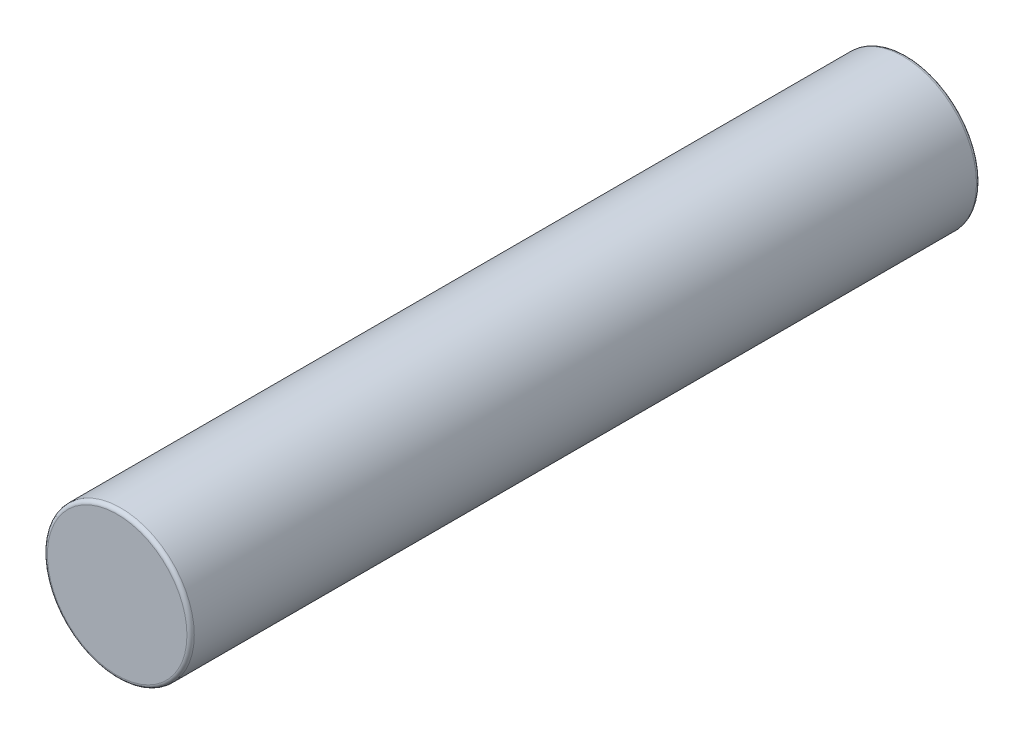
ISO-10303-21;
HEADER;
FILE_DESCRIPTION(('STEP AP214'),'2;1');
FILE_NAME('part.step','',(''),(''),'','','');
FILE_SCHEMA(('AUTOMOTIVE_DESIGN { 1 0 10303 214 1 1 1 1 }'));
ENDSEC;
DATA;
#1=APPLICATION_CONTEXT('core data for automotive mechanical design processes');
#2=APPLICATION_PROTOCOL_DEFINITION('international standard','automotive_design',2000,#1);
#3=PRODUCT_CONTEXT('',#1,'mechanical');
#4=PRODUCT('Part','Part','',(#3));
#5=PRODUCT_RELATED_PRODUCT_CATEGORY('part','',(#4));
#6=PRODUCT_DEFINITION_FORMATION('','',#4);
#7=PRODUCT_DEFINITION_CONTEXT('part definition',#1,'design');
#8=PRODUCT_DEFINITION('design','',#6,#7);
#9=PRODUCT_DEFINITION_SHAPE('','',#8);
#10=(LENGTH_UNIT() NAMED_UNIT(*) SI_UNIT(.MILLI.,.METRE.));
#11=(NAMED_UNIT(*) PLANE_ANGLE_UNIT() SI_UNIT($,.RADIAN.));
#12=(NAMED_UNIT(*) SI_UNIT($,.STERADIAN.) SOLID_ANGLE_UNIT());
#13=UNCERTAINTY_MEASURE_WITH_UNIT(LENGTH_MEASURE(1.E-05),#10,'distance_accuracy_value','');
#14=(GEOMETRIC_REPRESENTATION_CONTEXT(3) GLOBAL_UNCERTAINTY_ASSIGNED_CONTEXT((#13)) GLOBAL_UNIT_ASSIGNED_CONTEXT((#10,
#11,#12)) REPRESENTATION_CONTEXT('',''));
#15=CARTESIAN_POINT('',(0.,0.,0.));
#16=DIRECTION('',(0.,0.,1.));
#17=DIRECTION('',(1.,0.,0.));
#18=AXIS2_PLACEMENT_3D('',#15,#16,#17);
#19=CARTESIAN_POINT('',(0.,0.,21.5));
#20=DIRECTION('',(0.,0.,-1.));
#21=DIRECTION('',(-1.,0.,0.));
#22=AXIS2_PLACEMENT_3D('',#19,#20,#21);
#23=CYLINDRICAL_SURFACE('',#22,2.);
#24=CARTESIAN_POINT('',(0.,0.,21.4));
#25=DIRECTION('',(0.,0.,1.));
#26=DIRECTION('',(1.,0.,0.));
#27=AXIS2_PLACEMENT_3D('',#24,#25,#26);
#28=CIRCLE('',#27,2.);
#29=CARTESIAN_POINT('',(2.,0.,21.4));
#30=VERTEX_POINT('',#29);
#31=EDGE_CURVE('E39',#30,#30,#28,.F.);
#32=ORIENTED_EDGE('',*,*,#31,.T.);
#33=EDGE_LOOP('',(#32));
#34=FACE_BOUND('',#33,.T.);
#35=CARTESIAN_POINT('',(0.,0.,0.0999999999999994));
#36=DIRECTION('',(0.,0.,1.));
#37=DIRECTION('',(1.,0.,0.));
#38=AXIS2_PLACEMENT_3D('',#35,#36,#37);
#39=CIRCLE('',#38,2.);
#40=CARTESIAN_POINT('',(2.,0.,0.0999999999999994));
#41=VERTEX_POINT('',#40);
#42=EDGE_CURVE('E43',#41,#41,#39,.T.);
#43=ORIENTED_EDGE('',*,*,#42,.T.);
#44=EDGE_LOOP('',(#43));
#45=FACE_BOUND('',#44,.T.);
#46=ADVANCED_FACE('F32',(#34,#45),#23,.T.);
#47=CARTESIAN_POINT('',(0.,0.,21.5));
#48=DIRECTION('',(0.,0.,1.));
#49=DIRECTION('',(1.,0.,0.));
#50=AXIS2_PLACEMENT_3D('',#47,#48,#49);
#51=PLANE('',#50);
#52=CARTESIAN_POINT('',(0.,0.,21.5));
#53=DIRECTION('',(0.,0.,1.));
#54=DIRECTION('',(1.,0.,0.));
#55=AXIS2_PLACEMENT_3D('',#52,#53,#54);
#56=CIRCLE('',#55,1.9);
#57=CARTESIAN_POINT('',(1.9,0.,21.5));
#58=VERTEX_POINT('',#57);
#59=EDGE_CURVE('E47',#58,#58,#56,.T.);
#60=ORIENTED_EDGE('',*,*,#59,.T.);
#61=EDGE_LOOP('',(#60));
#62=FACE_BOUND('',#61,.T.);
#63=ADVANCED_FACE('F53',(#62),#51,.T.);
#64=CARTESIAN_POINT('',(0.,0.,0.));
#65=DIRECTION('',(0.,0.,1.));
#66=DIRECTION('',(1.,0.,0.));
#67=AXIS2_PLACEMENT_3D('',#64,#65,#66);
#68=PLANE('',#67);
#69=CARTESIAN_POINT('',(0.,0.,0.));
#70=DIRECTION('',(0.,0.,1.));
#71=DIRECTION('',(1.,0.,0.));
#72=AXIS2_PLACEMENT_3D('',#69,#70,#71);
#73=CIRCLE('',#72,1.9);
#74=CARTESIAN_POINT('',(1.9,0.,0.));
#75=VERTEX_POINT('',#74);
#76=EDGE_CURVE('E10',#75,#75,#73,.F.);
#77=ORIENTED_EDGE('',*,*,#76,.T.);
#78=EDGE_LOOP('',(#77));
#79=FACE_BOUND('',#78,.T.);
#80=ADVANCED_FACE('F57',(#79),#68,.F.);
#81=CARTESIAN_POINT('',(0.,0.,21.4));
#82=DIRECTION('',(0.,0.,1.));
#83=DIRECTION('',(1.,0.,0.));
#84=AXIS2_PLACEMENT_3D('',#81,#82,#83);
#85=TOROIDAL_SURFACE('',#84,1.9,0.1);
#86=ORIENTED_EDGE('',*,*,#31,.F.);
#87=EDGE_LOOP('',(#86));
#88=FACE_BOUND('',#87,.T.);
#89=ORIENTED_EDGE('',*,*,#59,.F.);
#90=EDGE_LOOP('',(#89));
#91=FACE_BOUND('',#90,.T.);
#92=ADVANCED_FACE('F55',(#88,#91),#85,.T.);
#93=CARTESIAN_POINT('',(0.,0.,0.0999999999999994));
#94=DIRECTION('',(0.,0.,1.));
#95=DIRECTION('',(1.,0.,0.));
#96=AXIS2_PLACEMENT_3D('',#93,#94,#95);
#97=TOROIDAL_SURFACE('',#96,1.9,0.1);
#98=ORIENTED_EDGE('',*,*,#76,.F.);
#99=EDGE_LOOP('',(#98));
#100=FACE_BOUND('',#99,.T.);
#101=ORIENTED_EDGE('',*,*,#42,.F.);
#102=EDGE_LOOP('',(#101));
#103=FACE_BOUND('',#102,.T.);
#104=ADVANCED_FACE('F34',(#100,#103),#97,.T.);
#105=CLOSED_SHELL('',(#46,#63,#80,#92,#104));
#106=MANIFOLD_SOLID_BREP('B2',#105);
#107=ADVANCED_BREP_SHAPE_REPRESENTATION('',(#18,#106),#14);
#108=SHAPE_DEFINITION_REPRESENTATION(#9,#107);
ENDSEC;
END-ISO-10303-21;
